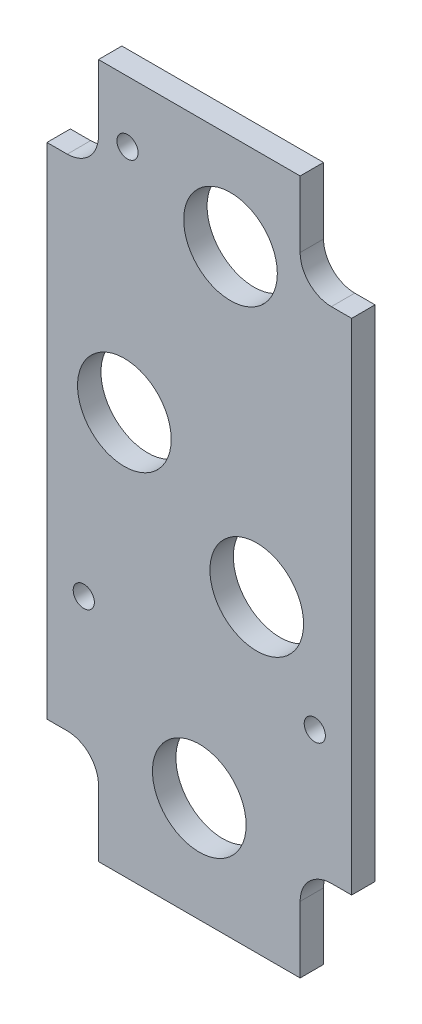
ISO-10303-21;
HEADER;
FILE_DESCRIPTION(('STEP AP214'),'2;1');
FILE_NAME('part.step','',(''),(''),'','','');
FILE_SCHEMA(('AUTOMOTIVE_DESIGN { 1 0 10303 214 1 1 1 1 }'));
ENDSEC;
DATA;
#1=APPLICATION_CONTEXT('core data for automotive mechanical design processes');
#2=APPLICATION_PROTOCOL_DEFINITION('international standard','automotive_design',2000,#1);
#3=PRODUCT_CONTEXT('',#1,'mechanical');
#4=PRODUCT('Part','Part','',(#3));
#5=PRODUCT_RELATED_PRODUCT_CATEGORY('part','',(#4));
#6=PRODUCT_DEFINITION_FORMATION('','',#4);
#7=PRODUCT_DEFINITION_CONTEXT('part definition',#1,'design');
#8=PRODUCT_DEFINITION('design','',#6,#7);
#9=PRODUCT_DEFINITION_SHAPE('','',#8);
#10=(LENGTH_UNIT() NAMED_UNIT(*) SI_UNIT(.MILLI.,.METRE.));
#11=(NAMED_UNIT(*) PLANE_ANGLE_UNIT() SI_UNIT($,.RADIAN.));
#12=(NAMED_UNIT(*) SI_UNIT($,.STERADIAN.) SOLID_ANGLE_UNIT());
#13=UNCERTAINTY_MEASURE_WITH_UNIT(LENGTH_MEASURE(1.E-05),#10,'distance_accuracy_value','');
#14=(GEOMETRIC_REPRESENTATION_CONTEXT(3) GLOBAL_UNCERTAINTY_ASSIGNED_CONTEXT((#13)) GLOBAL_UNIT_ASSIGNED_CONTEXT((#10,
#11,#12)) REPRESENTATION_CONTEXT('',''));
#15=CARTESIAN_POINT('',(0.,0.,0.));
#16=DIRECTION('',(0.,0.,1.));
#17=DIRECTION('',(1.,0.,0.));
#18=AXIS2_PLACEMENT_3D('',#15,#16,#17);
#19=CARTESIAN_POINT('',(-26.8605000000001,-128.5875,-1.0795));
#20=DIRECTION('',(0.,0.,-1.));
#21=DIRECTION('',(-1.,0.,0.));
#22=AXIS2_PLACEMENT_3D('',#19,#20,#21);
#23=CYLINDRICAL_SURFACE('',#22,6.34999999999999);
#24=CARTESIAN_POINT('',(-26.8605000000001,-128.5875,-5.842));
#25=DIRECTION('',(0.,0.,-1.));
#26=DIRECTION('',(1.,0.,0.));
#27=AXIS2_PLACEMENT_3D('',#24,#25,#26);
#28=CIRCLE('',#27,6.34999999999999);
#29=CARTESIAN_POINT('',(-26.8605000000001,-122.2375,-5.842));
#30=VERTEX_POINT('',#29);
#31=CARTESIAN_POINT('',(-20.5105000000001,-128.5875,-5.842));
#32=VERTEX_POINT('',#31);
#33=EDGE_CURVE('E176',#30,#32,#28,.T.);
#34=ORIENTED_EDGE('',*,*,#33,.T.);
#35=DIRECTION('',(0.,0.,-1.));
#36=VECTOR('',#35,1.);
#37=CARTESIAN_POINT('',(-20.5105000000001,-128.5875,-1.0795));
#38=LINE('',#37,#36);
#39=CARTESIAN_POINT('',(-20.5105000000001,-128.5875,-1.0795));
#40=VERTEX_POINT('',#39);
#41=EDGE_CURVE('E11',#40,#32,#38,.T.);
#42=ORIENTED_EDGE('',*,*,#41,.F.);
#43=CARTESIAN_POINT('',(-26.8605000000001,-128.5875,-1.0795));
#44=DIRECTION('',(0.,0.,-1.));
#45=DIRECTION('',(1.,0.,0.));
#46=AXIS2_PLACEMENT_3D('',#43,#44,#45);
#47=CIRCLE('',#46,6.34999999999999);
#48=CARTESIAN_POINT('',(-26.8605000000001,-122.2375,-1.0795));
#49=VERTEX_POINT('',#48);
#50=EDGE_CURVE('E207',#49,#40,#47,.T.);
#51=ORIENTED_EDGE('',*,*,#50,.F.);
#52=DIRECTION('',(0.,0.,-1.));
#53=VECTOR('',#52,1.);
#54=CARTESIAN_POINT('',(-26.8605000000001,-122.2375,-1.0795));
#55=LINE('',#54,#53);
#56=EDGE_CURVE('E172',#49,#30,#55,.T.);
#57=ORIENTED_EDGE('',*,*,#56,.T.);
#58=EDGE_LOOP('',(#34,#42,#51,#57));
#59=FACE_BOUND('',#58,.T.);
#60=ADVANCED_FACE('F32',(#59),#23,.F.);
#61=CARTESIAN_POINT('',(-20.5105000000001,-128.5875,-1.0795));
#62=DIRECTION('',(1.,0.,0.));
#63=DIRECTION('',(0.,0.,-1.));
#64=AXIS2_PLACEMENT_3D('',#61,#62,#63);
#65=PLANE('',#64);
#66=DIRECTION('',(0.,-1.,0.));
#67=VECTOR('',#66,1.);
#68=CARTESIAN_POINT('',(-20.5105000000001,-128.5875,-5.842));
#69=LINE('',#68,#67);
#70=CARTESIAN_POINT('',(-20.5105000000001,-142.08125,-5.842));
#71=VERTEX_POINT('',#70);
#72=EDGE_CURVE('E179',#32,#71,#69,.T.);
#73=ORIENTED_EDGE('',*,*,#72,.T.);
#74=DIRECTION('',(0.,0.,-1.));
#75=VECTOR('',#74,1.);
#76=CARTESIAN_POINT('',(-20.5105000000001,-142.08125,-1.0795));
#77=LINE('',#76,#75);
#78=CARTESIAN_POINT('',(-20.5105000000001,-142.08125,-1.0795));
#79=VERTEX_POINT('',#78);
#80=EDGE_CURVE('E40',#79,#71,#77,.T.);
#81=ORIENTED_EDGE('',*,*,#80,.F.);
#82=DIRECTION('',(0.,-1.,0.));
#83=VECTOR('',#82,1.);
#84=CARTESIAN_POINT('',(-20.5105000000001,-128.5875,-1.0795));
#85=LINE('',#84,#83);
#86=EDGE_CURVE('E115',#40,#79,#85,.T.);
#87=ORIENTED_EDGE('',*,*,#86,.F.);
#88=ORIENTED_EDGE('',*,*,#41,.T.);
#89=EDGE_LOOP('',(#73,#81,#87,#88));
#90=FACE_BOUND('',#89,.T.);
#91=ADVANCED_FACE('F306',(#90),#65,.F.);
#92=CARTESIAN_POINT('',(-20.5105000000001,-142.08125,-1.0795));
#93=DIRECTION('',(0.,1.,0.));
#94=DIRECTION('',(0.,0.,1.));
#95=AXIS2_PLACEMENT_3D('',#92,#93,#94);
#96=PLANE('',#95);
#97=DIRECTION('',(1.,0.,0.));
#98=VECTOR('',#97,1.);
#99=CARTESIAN_POINT('',(-20.5105000000001,-142.08125,-5.842));
#100=LINE('',#99,#98);
#101=CARTESIAN_POINT('',(20.5105,-142.08125,-5.842));
#102=VERTEX_POINT('',#101);
#103=EDGE_CURVE('E182',#71,#102,#100,.T.);
#104=ORIENTED_EDGE('',*,*,#103,.T.);
#105=DIRECTION('',(0.,0.,-1.));
#106=VECTOR('',#105,1.);
#107=CARTESIAN_POINT('',(20.5105,-142.08125,-1.0795));
#108=LINE('',#107,#106);
#109=CARTESIAN_POINT('',(20.5105,-142.08125,-1.0795));
#110=VERTEX_POINT('',#109);
#111=EDGE_CURVE('E238',#110,#102,#108,.T.);
#112=ORIENTED_EDGE('',*,*,#111,.F.);
#113=DIRECTION('',(1.,0.,0.));
#114=VECTOR('',#113,1.);
#115=CARTESIAN_POINT('',(-20.5105000000001,-142.08125,-1.0795));
#116=LINE('',#115,#114);
#117=EDGE_CURVE('E246',#79,#110,#116,.T.);
#118=ORIENTED_EDGE('',*,*,#117,.F.);
#119=ORIENTED_EDGE('',*,*,#80,.T.);
#120=EDGE_LOOP('',(#104,#112,#118,#119));
#121=FACE_BOUND('',#120,.T.);
#122=ADVANCED_FACE('F244',(#121),#96,.F.);
#123=CARTESIAN_POINT('',(20.5105,-142.08125,-1.0795));
#124=DIRECTION('',(-1.,0.,0.));
#125=DIRECTION('',(0.,-1.,0.));
#126=AXIS2_PLACEMENT_3D('',#123,#124,#125);
#127=PLANE('',#126);
#128=DIRECTION('',(0.,1.,0.));
#129=VECTOR('',#128,1.);
#130=CARTESIAN_POINT('',(20.5105,-142.08125,-5.842));
#131=LINE('',#130,#129);
#132=CARTESIAN_POINT('',(20.5105,-128.5875,-5.842));
#133=VERTEX_POINT('',#132);
#134=EDGE_CURVE('E184',#102,#133,#131,.T.);
#135=ORIENTED_EDGE('',*,*,#134,.T.);
#136=DIRECTION('',(0.,0.,-1.));
#137=VECTOR('',#136,1.);
#138=CARTESIAN_POINT('',(20.5105,-128.5875,-1.0795));
#139=LINE('',#138,#137);
#140=CARTESIAN_POINT('',(20.5105,-128.5875,-1.0795));
#141=VERTEX_POINT('',#140);
#142=EDGE_CURVE('E235',#141,#133,#139,.T.);
#143=ORIENTED_EDGE('',*,*,#142,.F.);
#144=DIRECTION('',(0.,1.,0.));
#145=VECTOR('',#144,1.);
#146=CARTESIAN_POINT('',(20.5105,-142.08125,-1.0795));
#147=LINE('',#146,#145);
#148=EDGE_CURVE('E264',#110,#141,#147,.T.);
#149=ORIENTED_EDGE('',*,*,#148,.F.);
#150=ORIENTED_EDGE('',*,*,#111,.T.);
#151=EDGE_LOOP('',(#135,#143,#149,#150));
#152=FACE_BOUND('',#151,.T.);
#153=ADVANCED_FACE('F255',(#152),#127,.F.);
#154=CARTESIAN_POINT('',(26.8605,-128.5875,-1.0795));
#155=DIRECTION('',(0.,0.,-1.));
#156=DIRECTION('',(-1.,0.,0.));
#157=AXIS2_PLACEMENT_3D('',#154,#155,#156);
#158=CYLINDRICAL_SURFACE('',#157,6.34999999999998);
#159=CARTESIAN_POINT('',(26.8605,-128.5875,-5.842));
#160=DIRECTION('',(0.,0.,-1.));
#161=DIRECTION('',(1.,0.,0.));
#162=AXIS2_PLACEMENT_3D('',#159,#160,#161);
#163=CIRCLE('',#162,6.34999999999998);
#164=CARTESIAN_POINT('',(26.8605,-122.2375,-5.842));
#165=VERTEX_POINT('',#164);
#166=EDGE_CURVE('E186',#133,#165,#163,.T.);
#167=ORIENTED_EDGE('',*,*,#166,.T.);
#168=DIRECTION('',(0.,0.,-1.));
#169=VECTOR('',#168,1.);
#170=CARTESIAN_POINT('',(26.8605,-122.2375,-1.0795));
#171=LINE('',#170,#169);
#172=CARTESIAN_POINT('',(26.8605,-122.2375,-1.0795));
#173=VERTEX_POINT('',#172);
#174=EDGE_CURVE('E232',#173,#165,#171,.T.);
#175=ORIENTED_EDGE('',*,*,#174,.F.);
#176=CARTESIAN_POINT('',(26.8605,-128.5875,-1.0795));
#177=DIRECTION('',(0.,0.,-1.));
#178=DIRECTION('',(1.,0.,0.));
#179=AXIS2_PLACEMENT_3D('',#176,#177,#178);
#180=CIRCLE('',#179,6.34999999999998);
#181=EDGE_CURVE('E261',#141,#173,#180,.T.);
#182=ORIENTED_EDGE('',*,*,#181,.F.);
#183=ORIENTED_EDGE('',*,*,#142,.T.);
#184=EDGE_LOOP('',(#167,#175,#182,#183));
#185=FACE_BOUND('',#184,.T.);
#186=ADVANCED_FACE('F259',(#185),#158,.F.);
#187=CARTESIAN_POINT('',(26.8605,-122.2375,-1.0795));
#188=DIRECTION('',(0.,1.,0.));
#189=DIRECTION('',(0.,0.,1.));
#190=AXIS2_PLACEMENT_3D('',#187,#188,#189);
#191=PLANE('',#190);
#192=DIRECTION('',(1.,0.,0.));
#193=VECTOR('',#192,1.);
#194=CARTESIAN_POINT('',(26.8605,-122.2375,-5.842));
#195=LINE('',#194,#193);
#196=CARTESIAN_POINT('',(30.988,-122.2375,-5.842));
#197=VERTEX_POINT('',#196);
#198=EDGE_CURVE('E188',#165,#197,#195,.T.);
#199=ORIENTED_EDGE('',*,*,#198,.T.);
#200=DIRECTION('',(0.,0.,-1.));
#201=VECTOR('',#200,1.);
#202=CARTESIAN_POINT('',(30.988,-122.2375,-1.0795));
#203=LINE('',#202,#201);
#204=CARTESIAN_POINT('',(30.988,-122.2375,-1.0795));
#205=VERTEX_POINT('',#204);
#206=EDGE_CURVE('E229',#205,#197,#203,.T.);
#207=ORIENTED_EDGE('',*,*,#206,.F.);
#208=DIRECTION('',(1.,0.,0.));
#209=VECTOR('',#208,1.);
#210=CARTESIAN_POINT('',(26.8605,-122.2375,-1.0795));
#211=LINE('',#210,#209);
#212=EDGE_CURVE('E263',#173,#205,#211,.T.);
#213=ORIENTED_EDGE('',*,*,#212,.F.);
#214=ORIENTED_EDGE('',*,*,#174,.T.);
#215=EDGE_LOOP('',(#199,#207,#213,#214));
#216=FACE_BOUND('',#215,.T.);
#217=ADVANCED_FACE('F319',(#216),#191,.F.);
#218=CARTESIAN_POINT('',(30.988,-122.2375,-1.0795));
#219=DIRECTION('',(-1.,0.,0.));
#220=DIRECTION('',(0.,0.,1.));
#221=AXIS2_PLACEMENT_3D('',#218,#219,#220);
#222=PLANE('',#221);
#223=DIRECTION('',(0.,1.,0.));
#224=VECTOR('',#223,1.);
#225=CARTESIAN_POINT('',(30.988,-122.2375,-5.842));
#226=LINE('',#225,#224);
#227=CARTESIAN_POINT('',(30.988,-20.6375,-5.842));
#228=VERTEX_POINT('',#227);
#229=EDGE_CURVE('E190',#197,#228,#226,.T.);
#230=ORIENTED_EDGE('',*,*,#229,.T.);
#231=DIRECTION('',(0.,0.,-1.));
#232=VECTOR('',#231,1.);
#233=CARTESIAN_POINT('',(30.988,-20.6375,-1.0795));
#234=LINE('',#233,#232);
#235=CARTESIAN_POINT('',(30.988,-20.6375,-1.0795));
#236=VERTEX_POINT('',#235);
#237=EDGE_CURVE('E226',#236,#228,#234,.T.);
#238=ORIENTED_EDGE('',*,*,#237,.F.);
#239=DIRECTION('',(0.,1.,0.));
#240=VECTOR('',#239,1.);
#241=CARTESIAN_POINT('',(30.988,-122.2375,-1.0795));
#242=LINE('',#241,#240);
#243=EDGE_CURVE('E266',#205,#236,#242,.T.);
#244=ORIENTED_EDGE('',*,*,#243,.F.);
#245=ORIENTED_EDGE('',*,*,#206,.T.);
#246=EDGE_LOOP('',(#230,#238,#244,#245));
#247=FACE_BOUND('',#246,.T.);
#248=ADVANCED_FACE('F322',(#247),#222,.F.);
#249=CARTESIAN_POINT('',(30.988,-20.6375,-1.0795));
#250=DIRECTION('',(0.,-1.,0.));
#251=DIRECTION('',(0.,0.,-1.));
#252=AXIS2_PLACEMENT_3D('',#249,#250,#251);
#253=PLANE('',#252);
#254=DIRECTION('',(-1.,0.,0.));
#255=VECTOR('',#254,1.);
#256=CARTESIAN_POINT('',(30.988,-20.6375,-5.842));
#257=LINE('',#256,#255);
#258=CARTESIAN_POINT('',(26.8605,-20.6375,-5.842));
#259=VERTEX_POINT('',#258);
#260=EDGE_CURVE('E192',#228,#259,#257,.T.);
#261=ORIENTED_EDGE('',*,*,#260,.T.);
#262=DIRECTION('',(0.,0.,-1.));
#263=VECTOR('',#262,1.);
#264=CARTESIAN_POINT('',(26.8605,-20.6375,-1.0795));
#265=LINE('',#264,#263);
#266=CARTESIAN_POINT('',(26.8605,-20.6375,-1.0795));
#267=VERTEX_POINT('',#266);
#268=EDGE_CURVE('E223',#267,#259,#265,.T.);
#269=ORIENTED_EDGE('',*,*,#268,.F.);
#270=DIRECTION('',(-1.,0.,0.));
#271=VECTOR('',#270,1.);
#272=CARTESIAN_POINT('',(30.988,-20.6375,-1.0795));
#273=LINE('',#272,#271);
#274=EDGE_CURVE('E272',#236,#267,#273,.T.);
#275=ORIENTED_EDGE('',*,*,#274,.F.);
#276=ORIENTED_EDGE('',*,*,#237,.T.);
#277=EDGE_LOOP('',(#261,#269,#275,#276));
#278=FACE_BOUND('',#277,.T.);
#279=ADVANCED_FACE('F326',(#278),#253,.F.);
#280=CARTESIAN_POINT('',(26.8605,-14.2875,-1.0795));
#281=DIRECTION('',(0.,0.,-1.));
#282=DIRECTION('',(-1.,0.,0.));
#283=AXIS2_PLACEMENT_3D('',#280,#281,#282);
#284=CYLINDRICAL_SURFACE('',#283,6.35);
#285=CARTESIAN_POINT('',(26.8605,-14.2875,-5.842));
#286=DIRECTION('',(0.,0.,-1.));
#287=DIRECTION('',(1.,0.,0.));
#288=AXIS2_PLACEMENT_3D('',#285,#286,#287);
#289=CIRCLE('',#288,6.35);
#290=CARTESIAN_POINT('',(20.5105,-14.2875,-5.842));
#291=VERTEX_POINT('',#290);
#292=EDGE_CURVE('E194',#259,#291,#289,.T.);
#293=ORIENTED_EDGE('',*,*,#292,.T.);
#294=DIRECTION('',(0.,0.,-1.));
#295=VECTOR('',#294,1.);
#296=CARTESIAN_POINT('',(20.5105,-14.2875,-1.0795));
#297=LINE('',#296,#295);
#298=CARTESIAN_POINT('',(20.5105,-14.2875,-1.0795));
#299=VERTEX_POINT('',#298);
#300=EDGE_CURVE('E220',#299,#291,#297,.T.);
#301=ORIENTED_EDGE('',*,*,#300,.F.);
#302=CARTESIAN_POINT('',(26.8605,-14.2875,-1.0795));
#303=DIRECTION('',(0.,0.,-1.));
#304=DIRECTION('',(1.,0.,0.));
#305=AXIS2_PLACEMENT_3D('',#302,#303,#304);
#306=CIRCLE('',#305,6.35);
#307=EDGE_CURVE('E274',#267,#299,#306,.T.);
#308=ORIENTED_EDGE('',*,*,#307,.F.);
#309=ORIENTED_EDGE('',*,*,#268,.T.);
#310=EDGE_LOOP('',(#293,#301,#308,#309));
#311=FACE_BOUND('',#310,.T.);
#312=ADVANCED_FACE('F330',(#311),#284,.F.);
#313=CARTESIAN_POINT('',(20.5105,-14.2875,-1.0795));
#314=DIRECTION('',(-1.,0.,0.));
#315=DIRECTION('',(0.,-1.,0.));
#316=AXIS2_PLACEMENT_3D('',#313,#314,#315);
#317=PLANE('',#316);
#318=DIRECTION('',(0.,1.,0.));
#319=VECTOR('',#318,1.);
#320=CARTESIAN_POINT('',(20.5105,-14.2875,-5.842));
#321=LINE('',#320,#319);
#322=CARTESIAN_POINT('',(20.5105,-0.79375000000001,-5.842));
#323=VERTEX_POINT('',#322);
#324=EDGE_CURVE('E196',#291,#323,#321,.T.);
#325=ORIENTED_EDGE('',*,*,#324,.T.);
#326=DIRECTION('',(0.,0.,-1.));
#327=VECTOR('',#326,1.);
#328=CARTESIAN_POINT('',(20.5105,-0.79375000000001,-1.0795));
#329=LINE('',#328,#327);
#330=CARTESIAN_POINT('',(20.5105,-0.79375000000001,-1.0795));
#331=VERTEX_POINT('',#330);
#332=EDGE_CURVE('E217',#331,#323,#329,.T.);
#333=ORIENTED_EDGE('',*,*,#332,.F.);
#334=DIRECTION('',(0.,1.,0.));
#335=VECTOR('',#334,1.);
#336=CARTESIAN_POINT('',(20.5105,-14.2875,-1.0795));
#337=LINE('',#336,#335);
#338=EDGE_CURVE('E276',#299,#331,#337,.T.);
#339=ORIENTED_EDGE('',*,*,#338,.F.);
#340=ORIENTED_EDGE('',*,*,#300,.T.);
#341=EDGE_LOOP('',(#325,#333,#339,#340));
#342=FACE_BOUND('',#341,.T.);
#343=ADVANCED_FACE('F334',(#342),#317,.F.);
#344=CARTESIAN_POINT('',(20.5105,-0.79375000000001,-1.0795));
#345=DIRECTION('',(0.,-1.,0.));
#346=DIRECTION('',(0.,0.,-1.));
#347=AXIS2_PLACEMENT_3D('',#344,#345,#346);
#348=PLANE('',#347);
#349=DIRECTION('',(-1.,0.,0.));
#350=VECTOR('',#349,1.);
#351=CARTESIAN_POINT('',(20.5105,-0.79375000000001,-5.842));
#352=LINE('',#351,#350);
#353=CARTESIAN_POINT('',(-20.5105000000001,-0.79375000000001,-5.842));
#354=VERTEX_POINT('',#353);
#355=EDGE_CURVE('E198',#323,#354,#352,.T.);
#356=ORIENTED_EDGE('',*,*,#355,.T.);
#357=DIRECTION('',(0.,0.,-1.));
#358=VECTOR('',#357,1.);
#359=CARTESIAN_POINT('',(-20.5105000000001,-0.79375000000001,-1.0795));
#360=LINE('',#359,#358);
#361=CARTESIAN_POINT('',(-20.5105000000001,-0.79375000000001,-1.0795));
#362=VERTEX_POINT('',#361);
#363=EDGE_CURVE('E214',#362,#354,#360,.T.);
#364=ORIENTED_EDGE('',*,*,#363,.F.);
#365=DIRECTION('',(-1.,0.,0.));
#366=VECTOR('',#365,1.);
#367=CARTESIAN_POINT('',(20.5105,-0.79375000000001,-1.0795));
#368=LINE('',#367,#366);
#369=EDGE_CURVE('E278',#331,#362,#368,.T.);
#370=ORIENTED_EDGE('',*,*,#369,.F.);
#371=ORIENTED_EDGE('',*,*,#332,.T.);
#372=EDGE_LOOP('',(#356,#364,#370,#371));
#373=FACE_BOUND('',#372,.T.);
#374=ADVANCED_FACE('F338',(#373),#348,.F.);
#375=CARTESIAN_POINT('',(-20.5105000000001,-0.79375000000001,-1.0795));
#376=DIRECTION('',(1.,0.,0.));
#377=DIRECTION('',(0.,0.,-1.));
#378=AXIS2_PLACEMENT_3D('',#375,#376,#377);
#379=PLANE('',#378);
#380=DIRECTION('',(0.,-1.,0.));
#381=VECTOR('',#380,1.);
#382=CARTESIAN_POINT('',(-20.5105000000001,-0.79375000000001,-5.842));
#383=LINE('',#382,#381);
#384=CARTESIAN_POINT('',(-20.5105000000001,-14.2875,-5.842));
#385=VERTEX_POINT('',#384);
#386=EDGE_CURVE('E200',#354,#385,#383,.T.);
#387=ORIENTED_EDGE('',*,*,#386,.T.);
#388=DIRECTION('',(0.,0.,-1.));
#389=VECTOR('',#388,1.);
#390=CARTESIAN_POINT('',(-20.5105000000001,-14.2875,-1.0795));
#391=LINE('',#390,#389);
#392=CARTESIAN_POINT('',(-20.5105000000001,-14.2875,-1.0795));
#393=VERTEX_POINT('',#392);
#394=EDGE_CURVE('E211',#393,#385,#391,.T.);
#395=ORIENTED_EDGE('',*,*,#394,.F.);
#396=DIRECTION('',(0.,-1.,0.));
#397=VECTOR('',#396,1.);
#398=CARTESIAN_POINT('',(-20.5105000000001,-0.79375000000001,-1.0795));
#399=LINE('',#398,#397);
#400=EDGE_CURVE('E280',#362,#393,#399,.T.);
#401=ORIENTED_EDGE('',*,*,#400,.F.);
#402=ORIENTED_EDGE('',*,*,#363,.T.);
#403=EDGE_LOOP('',(#387,#395,#401,#402));
#404=FACE_BOUND('',#403,.T.);
#405=ADVANCED_FACE('F286',(#404),#379,.F.);
#406=CARTESIAN_POINT('',(-26.8605000000001,-14.2875,-1.0795));
#407=DIRECTION('',(0.,0.,-1.));
#408=DIRECTION('',(-1.,0.,0.));
#409=AXIS2_PLACEMENT_3D('',#406,#407,#408);
#410=CYLINDRICAL_SURFACE('',#409,6.35);
#411=CARTESIAN_POINT('',(-26.8605000000001,-14.2875,-5.842));
#412=DIRECTION('',(0.,0.,-1.));
#413=DIRECTION('',(1.,0.,0.));
#414=AXIS2_PLACEMENT_3D('',#411,#412,#413);
#415=CIRCLE('',#414,6.35);
#416=CARTESIAN_POINT('',(-26.8605000000001,-20.6375,-5.842));
#417=VERTEX_POINT('',#416);
#418=EDGE_CURVE('E202',#385,#417,#415,.T.);
#419=ORIENTED_EDGE('',*,*,#418,.T.);
#420=DIRECTION('',(0.,0.,-1.));
#421=VECTOR('',#420,1.);
#422=CARTESIAN_POINT('',(-26.8605000000001,-20.6375,-1.0795));
#423=LINE('',#422,#421);
#424=CARTESIAN_POINT('',(-26.8605000000001,-20.6375,-1.0795));
#425=VERTEX_POINT('',#424);
#426=EDGE_CURVE('E167',#425,#417,#423,.T.);
#427=ORIENTED_EDGE('',*,*,#426,.F.);
#428=CARTESIAN_POINT('',(-26.8605000000001,-14.2875,-1.0795));
#429=DIRECTION('',(0.,0.,-1.));
#430=DIRECTION('',(1.,0.,0.));
#431=AXIS2_PLACEMENT_3D('',#428,#429,#430);
#432=CIRCLE('',#431,6.35);
#433=EDGE_CURVE('E158',#393,#425,#432,.T.);
#434=ORIENTED_EDGE('',*,*,#433,.F.);
#435=ORIENTED_EDGE('',*,*,#394,.T.);
#436=EDGE_LOOP('',(#419,#427,#434,#435));
#437=FACE_BOUND('',#436,.T.);
#438=ADVANCED_FACE('F290',(#437),#410,.F.);
#439=CARTESIAN_POINT('',(-26.8605000000001,-20.6375,-1.0795));
#440=DIRECTION('',(0.,-1.,0.));
#441=DIRECTION('',(0.,0.,-1.));
#442=AXIS2_PLACEMENT_3D('',#439,#440,#441);
#443=PLANE('',#442);
#444=DIRECTION('',(-1.,0.,0.));
#445=VECTOR('',#444,1.);
#446=CARTESIAN_POINT('',(-26.8605000000001,-20.6375,-5.842));
#447=LINE('',#446,#445);
#448=CARTESIAN_POINT('',(-30.9880000000001,-20.6375,-5.842));
#449=VERTEX_POINT('',#448);
#450=EDGE_CURVE('E166',#417,#449,#447,.T.);
#451=ORIENTED_EDGE('',*,*,#450,.T.);
#452=DIRECTION('',(0.,0.,-1.));
#453=VECTOR('',#452,1.);
#454=CARTESIAN_POINT('',(-30.9880000000001,-20.6375,-1.0795));
#455=LINE('',#454,#453);
#456=CARTESIAN_POINT('',(-30.9880000000001,-20.6375,-1.0795));
#457=VERTEX_POINT('',#456);
#458=EDGE_CURVE('E163',#457,#449,#455,.T.);
#459=ORIENTED_EDGE('',*,*,#458,.F.);
#460=DIRECTION('',(-1.,0.,0.));
#461=VECTOR('',#460,1.);
#462=CARTESIAN_POINT('',(-26.8605000000001,-20.6375,-1.0795));
#463=LINE('',#462,#461);
#464=EDGE_CURVE('E152',#425,#457,#463,.T.);
#465=ORIENTED_EDGE('',*,*,#464,.F.);
#466=ORIENTED_EDGE('',*,*,#426,.T.);
#467=EDGE_LOOP('',(#451,#459,#465,#466));
#468=FACE_BOUND('',#467,.T.);
#469=ADVANCED_FACE('F164',(#468),#443,.F.);
#470=CARTESIAN_POINT('',(-30.9880000000001,-20.6375,-1.0795));
#471=DIRECTION('',(1.,0.,0.));
#472=DIRECTION('',(0.,1.,0.));
#473=AXIS2_PLACEMENT_3D('',#470,#471,#472);
#474=PLANE('',#473);
#475=DIRECTION('',(0.,-1.,0.));
#476=VECTOR('',#475,1.);
#477=CARTESIAN_POINT('',(-30.9880000000001,-20.6375,-5.842));
#478=LINE('',#477,#476);
#479=CARTESIAN_POINT('',(-30.988,-122.2375,-5.842));
#480=VERTEX_POINT('',#479);
#481=EDGE_CURVE('E101',#449,#480,#478,.T.);
#482=ORIENTED_EDGE('',*,*,#481,.T.);
#483=DIRECTION('',(0.,0.,-1.));
#484=VECTOR('',#483,1.);
#485=CARTESIAN_POINT('',(-30.988,-122.2375,-1.0795));
#486=LINE('',#485,#484);
#487=CARTESIAN_POINT('',(-30.988,-122.2375,-1.0795));
#488=VERTEX_POINT('',#487);
#489=EDGE_CURVE('E168',#488,#480,#486,.T.);
#490=ORIENTED_EDGE('',*,*,#489,.F.);
#491=DIRECTION('',(0.,-1.,0.));
#492=VECTOR('',#491,1.);
#493=CARTESIAN_POINT('',(-30.9880000000001,-20.6375,-1.0795));
#494=LINE('',#493,#492);
#495=EDGE_CURVE('E156',#457,#488,#494,.T.);
#496=ORIENTED_EDGE('',*,*,#495,.F.);
#497=ORIENTED_EDGE('',*,*,#458,.T.);
#498=EDGE_LOOP('',(#482,#490,#496,#497));
#499=FACE_BOUND('',#498,.T.);
#500=ADVANCED_FACE('F170',(#499),#474,.F.);
#501=CARTESIAN_POINT('',(-30.988,-122.2375,-1.0795));
#502=DIRECTION('',(0.,1.,0.));
#503=DIRECTION('',(-1.,0.,0.));
#504=AXIS2_PLACEMENT_3D('',#501,#502,#503);
#505=PLANE('',#504);
#506=DIRECTION('',(1.,0.,0.));
#507=VECTOR('',#506,1.);
#508=CARTESIAN_POINT('',(-30.988,-122.2375,-5.842));
#509=LINE('',#508,#507);
#510=EDGE_CURVE('E107',#480,#30,#509,.T.);
#511=ORIENTED_EDGE('',*,*,#510,.T.);
#512=ORIENTED_EDGE('',*,*,#56,.F.);
#513=DIRECTION('',(1.,0.,0.));
#514=VECTOR('',#513,1.);
#515=CARTESIAN_POINT('',(-30.988,-122.2375,-1.0795));
#516=LINE('',#515,#514);
#517=EDGE_CURVE('E48',#488,#49,#516,.T.);
#518=ORIENTED_EDGE('',*,*,#517,.F.);
#519=ORIENTED_EDGE('',*,*,#489,.T.);
#520=EDGE_LOOP('',(#511,#512,#518,#519));
#521=FACE_BOUND('',#520,.T.);
#522=ADVANCED_FACE('F294',(#521),#505,.F.);
#523=CARTESIAN_POINT('',(-26.8605000000001,-128.5875,-1.0795));
#524=DIRECTION('',(0.,0.,1.));
#525=DIRECTION('',(1.,0.,0.));
#526=AXIS2_PLACEMENT_3D('',#523,#524,#525);
#527=PLANE('',#526);
#528=CARTESIAN_POINT('',(-15.2400000000001,-60.325,-1.0795));
#529=DIRECTION('',(0.,0.,1.));
#530=DIRECTION('',(1.,0.,0.));
#531=AXIS2_PLACEMENT_3D('',#528,#529,#530);
#532=CIRCLE('',#531,9.525);
#533=CARTESIAN_POINT('',(-5.71500000000005,-60.325,-1.0795));
#534=VERTEX_POINT('',#533);
#535=EDGE_CURVE('E454',#534,#534,#532,.T.);
#536=ORIENTED_EDGE('',*,*,#535,.F.);
#537=EDGE_LOOP('',(#536));
#538=FACE_BOUND('',#537,.T.);
#539=CARTESIAN_POINT('',(6.34999999999997,-20.32,-1.0795));
#540=DIRECTION('',(0.,0.,1.));
#541=DIRECTION('',(1.,0.,0.));
#542=AXIS2_PLACEMENT_3D('',#539,#540,#541);
#543=CIRCLE('',#542,9.525);
#544=CARTESIAN_POINT('',(15.875,-20.32,-1.0795));
#545=VERTEX_POINT('',#544);
#546=EDGE_CURVE('E456',#545,#545,#543,.T.);
#547=ORIENTED_EDGE('',*,*,#546,.F.);
#548=EDGE_LOOP('',(#547));
#549=FACE_BOUND('',#548,.T.);
#550=CARTESIAN_POINT('',(11.684,-79.375,-1.0795));
#551=DIRECTION('',(0.,0.,1.));
#552=DIRECTION('',(1.,0.,0.));
#553=AXIS2_PLACEMENT_3D('',#550,#551,#552);
#554=CIRCLE('',#553,9.525);
#555=CARTESIAN_POINT('',(21.209,-79.375,-1.0795));
#556=VERTEX_POINT('',#555);
#557=EDGE_CURVE('E464',#556,#556,#554,.T.);
#558=ORIENTED_EDGE('',*,*,#557,.F.);
#559=EDGE_LOOP('',(#558));
#560=FACE_BOUND('',#559,.T.);
#561=CARTESIAN_POINT('',(0.,-120.65,-1.0795));
#562=DIRECTION('',(0.,0.,1.));
#563=DIRECTION('',(1.,0.,0.));
#564=AXIS2_PLACEMENT_3D('',#561,#562,#563);
#565=CIRCLE('',#564,9.525);
#566=CARTESIAN_POINT('',(9.52499999999997,-120.65,-1.0795));
#567=VERTEX_POINT('',#566);
#568=EDGE_CURVE('E470',#567,#567,#565,.T.);
#569=ORIENTED_EDGE('',*,*,#568,.F.);
#570=EDGE_LOOP('',(#569));
#571=FACE_BOUND('',#570,.T.);
#572=CARTESIAN_POINT('',(-14.605,-13.208,-1.0795));
#573=DIRECTION('',(0.,0.,1.));
#574=DIRECTION('',(1.,0.,0.));
#575=AXIS2_PLACEMENT_3D('',#572,#573,#574);
#576=CIRCLE('',#575,2.15265);
#577=CARTESIAN_POINT('',(-12.45235,-13.208,-1.0795));
#578=VERTEX_POINT('',#577);
#579=EDGE_CURVE('E476',#578,#578,#576,.T.);
#580=ORIENTED_EDGE('',*,*,#579,.F.);
#581=EDGE_LOOP('',(#580));
#582=FACE_BOUND('',#581,.T.);
#583=CARTESIAN_POINT('',(-23.495,-96.8375,-1.0795));
#584=DIRECTION('',(0.,0.,1.));
#585=DIRECTION('',(1.,0.,0.));
#586=AXIS2_PLACEMENT_3D('',#583,#584,#585);
#587=CIRCLE('',#586,2.15265);
#588=CARTESIAN_POINT('',(-21.34235,-96.8375,-1.0795));
#589=VERTEX_POINT('',#588);
#590=EDGE_CURVE('E482',#589,#589,#587,.T.);
#591=ORIENTED_EDGE('',*,*,#590,.F.);
#592=EDGE_LOOP('',(#591));
#593=FACE_BOUND('',#592,.T.);
#594=CARTESIAN_POINT('',(23.495,-96.8375,-1.0795));
#595=DIRECTION('',(0.,0.,1.));
#596=DIRECTION('',(1.,0.,0.));
#597=AXIS2_PLACEMENT_3D('',#594,#595,#596);
#598=CIRCLE('',#597,2.15265);
#599=CARTESIAN_POINT('',(25.64765,-96.8375,-1.0795));
#600=VERTEX_POINT('',#599);
#601=EDGE_CURVE('E488',#600,#600,#598,.T.);
#602=ORIENTED_EDGE('',*,*,#601,.F.);
#603=EDGE_LOOP('',(#602));
#604=FACE_BOUND('',#603,.T.);
#605=ORIENTED_EDGE('',*,*,#50,.T.);
#606=ORIENTED_EDGE('',*,*,#86,.T.);
#607=ORIENTED_EDGE('',*,*,#117,.T.);
#608=ORIENTED_EDGE('',*,*,#148,.T.);
#609=ORIENTED_EDGE('',*,*,#181,.T.);
#610=ORIENTED_EDGE('',*,*,#212,.T.);
#611=ORIENTED_EDGE('',*,*,#243,.T.);
#612=ORIENTED_EDGE('',*,*,#274,.T.);
#613=ORIENTED_EDGE('',*,*,#307,.T.);
#614=ORIENTED_EDGE('',*,*,#338,.T.);
#615=ORIENTED_EDGE('',*,*,#369,.T.);
#616=ORIENTED_EDGE('',*,*,#400,.T.);
#617=ORIENTED_EDGE('',*,*,#433,.T.);
#618=ORIENTED_EDGE('',*,*,#464,.T.);
#619=ORIENTED_EDGE('',*,*,#495,.T.);
#620=ORIENTED_EDGE('',*,*,#517,.T.);
#621=EDGE_LOOP('',(#605,#606,#607,#608,#609,#610,#611,#612,#613,#614,#615,#616,#617,#618,#619,#620));
#622=FACE_BOUND('',#621,.T.);
#623=ADVANCED_FACE('F154',(#538,#549,#560,#571,#582,#593,#604,#622),#527,.T.);
#624=CARTESIAN_POINT('',(-26.8605000000001,-128.5875,-5.842));
#625=DIRECTION('',(0.,0.,1.));
#626=DIRECTION('',(1.,0.,0.));
#627=AXIS2_PLACEMENT_3D('',#624,#625,#626);
#628=PLANE('',#627);
#629=CARTESIAN_POINT('',(-15.2400000000001,-60.325,-5.842));
#630=DIRECTION('',(0.,0.,1.));
#631=DIRECTION('',(1.,0.,0.));
#632=AXIS2_PLACEMENT_3D('',#629,#630,#631);
#633=CIRCLE('',#632,9.525);
#634=CARTESIAN_POINT('',(-5.71500000000005,-60.325,-5.842));
#635=VERTEX_POINT('',#634);
#636=EDGE_CURVE('E451',#635,#635,#633,.T.);
#637=ORIENTED_EDGE('',*,*,#636,.T.);
#638=EDGE_LOOP('',(#637));
#639=FACE_BOUND('',#638,.T.);
#640=CARTESIAN_POINT('',(6.34999999999997,-20.32,-5.842));
#641=DIRECTION('',(0.,0.,1.));
#642=DIRECTION('',(1.,0.,0.));
#643=AXIS2_PLACEMENT_3D('',#640,#641,#642);
#644=CIRCLE('',#643,9.525);
#645=CARTESIAN_POINT('',(15.875,-20.32,-5.842));
#646=VERTEX_POINT('',#645);
#647=EDGE_CURVE('E461',#646,#646,#644,.T.);
#648=ORIENTED_EDGE('',*,*,#647,.T.);
#649=EDGE_LOOP('',(#648));
#650=FACE_BOUND('',#649,.T.);
#651=CARTESIAN_POINT('',(11.684,-79.375,-5.842));
#652=DIRECTION('',(0.,0.,1.));
#653=DIRECTION('',(1.,0.,0.));
#654=AXIS2_PLACEMENT_3D('',#651,#652,#653);
#655=CIRCLE('',#654,9.525);
#656=CARTESIAN_POINT('',(21.209,-79.375,-5.842));
#657=VERTEX_POINT('',#656);
#658=EDGE_CURVE('E467',#657,#657,#655,.T.);
#659=ORIENTED_EDGE('',*,*,#658,.T.);
#660=EDGE_LOOP('',(#659));
#661=FACE_BOUND('',#660,.T.);
#662=CARTESIAN_POINT('',(0.,-120.65,-5.842));
#663=DIRECTION('',(0.,0.,1.));
#664=DIRECTION('',(1.,0.,0.));
#665=AXIS2_PLACEMENT_3D('',#662,#663,#664);
#666=CIRCLE('',#665,9.525);
#667=CARTESIAN_POINT('',(9.52499999999997,-120.65,-5.842));
#668=VERTEX_POINT('',#667);
#669=EDGE_CURVE('E473',#668,#668,#666,.T.);
#670=ORIENTED_EDGE('',*,*,#669,.T.);
#671=EDGE_LOOP('',(#670));
#672=FACE_BOUND('',#671,.T.);
#673=CARTESIAN_POINT('',(-14.605,-13.208,-5.842));
#674=DIRECTION('',(0.,0.,1.));
#675=DIRECTION('',(1.,0.,0.));
#676=AXIS2_PLACEMENT_3D('',#673,#674,#675);
#677=CIRCLE('',#676,2.15265);
#678=CARTESIAN_POINT('',(-12.45235,-13.208,-5.842));
#679=VERTEX_POINT('',#678);
#680=EDGE_CURVE('E479',#679,#679,#677,.T.);
#681=ORIENTED_EDGE('',*,*,#680,.T.);
#682=EDGE_LOOP('',(#681));
#683=FACE_BOUND('',#682,.T.);
#684=CARTESIAN_POINT('',(-23.495,-96.8375,-5.842));
#685=DIRECTION('',(0.,0.,1.));
#686=DIRECTION('',(1.,0.,0.));
#687=AXIS2_PLACEMENT_3D('',#684,#685,#686);
#688=CIRCLE('',#687,2.15265);
#689=CARTESIAN_POINT('',(-21.34235,-96.8375,-5.842));
#690=VERTEX_POINT('',#689);
#691=EDGE_CURVE('E485',#690,#690,#688,.T.);
#692=ORIENTED_EDGE('',*,*,#691,.T.);
#693=EDGE_LOOP('',(#692));
#694=FACE_BOUND('',#693,.T.);
#695=CARTESIAN_POINT('',(23.495,-96.8375,-5.842));
#696=DIRECTION('',(0.,0.,1.));
#697=DIRECTION('',(1.,0.,0.));
#698=AXIS2_PLACEMENT_3D('',#695,#696,#697);
#699=CIRCLE('',#698,2.15265);
#700=CARTESIAN_POINT('',(25.64765,-96.8375,-5.842));
#701=VERTEX_POINT('',#700);
#702=EDGE_CURVE('E180',#701,#701,#699,.T.);
#703=ORIENTED_EDGE('',*,*,#702,.T.);
#704=EDGE_LOOP('',(#703));
#705=FACE_BOUND('',#704,.T.);
#706=ORIENTED_EDGE('',*,*,#33,.F.);
#707=ORIENTED_EDGE('',*,*,#510,.F.);
#708=ORIENTED_EDGE('',*,*,#481,.F.);
#709=ORIENTED_EDGE('',*,*,#450,.F.);
#710=ORIENTED_EDGE('',*,*,#418,.F.);
#711=ORIENTED_EDGE('',*,*,#386,.F.);
#712=ORIENTED_EDGE('',*,*,#355,.F.);
#713=ORIENTED_EDGE('',*,*,#324,.F.);
#714=ORIENTED_EDGE('',*,*,#292,.F.);
#715=ORIENTED_EDGE('',*,*,#260,.F.);
#716=ORIENTED_EDGE('',*,*,#229,.F.);
#717=ORIENTED_EDGE('',*,*,#198,.F.);
#718=ORIENTED_EDGE('',*,*,#166,.F.);
#719=ORIENTED_EDGE('',*,*,#134,.F.);
#720=ORIENTED_EDGE('',*,*,#103,.F.);
#721=ORIENTED_EDGE('',*,*,#72,.F.);
#722=EDGE_LOOP('',(#706,#707,#708,#709,#710,#711,#712,#713,#714,#715,#716,#717,#718,#719,#720,#721));
#723=FACE_BOUND('',#722,.T.);
#724=ADVANCED_FACE('F250',(#639,#650,#661,#672,#683,#694,#705,#723),#628,.F.);
#725=CARTESIAN_POINT('',(23.495,-96.8375,-1.0795));
#726=DIRECTION('',(0.,0.,1.));
#727=DIRECTION('',(1.,0.,0.));
#728=AXIS2_PLACEMENT_3D('',#725,#726,#727);
#729=CYLINDRICAL_SURFACE('',#728,2.15265);
#730=ORIENTED_EDGE('',*,*,#702,.F.);
#731=EDGE_LOOP('',(#730));
#732=FACE_BOUND('',#731,.T.);
#733=ORIENTED_EDGE('',*,*,#601,.T.);
#734=EDGE_LOOP('',(#733));
#735=FACE_BOUND('',#734,.T.);
#736=ADVANCED_FACE('F366',(#732,#735),#729,.F.);
#737=CARTESIAN_POINT('',(-23.495,-96.8375,-1.0795));
#738=DIRECTION('',(0.,0.,1.));
#739=DIRECTION('',(1.,0.,0.));
#740=AXIS2_PLACEMENT_3D('',#737,#738,#739);
#741=CYLINDRICAL_SURFACE('',#740,2.15265);
#742=ORIENTED_EDGE('',*,*,#691,.F.);
#743=EDGE_LOOP('',(#742));
#744=FACE_BOUND('',#743,.T.);
#745=ORIENTED_EDGE('',*,*,#590,.T.);
#746=EDGE_LOOP('',(#745));
#747=FACE_BOUND('',#746,.T.);
#748=ADVANCED_FACE('F371',(#744,#747),#741,.F.);
#749=CARTESIAN_POINT('',(-14.605,-13.208,-1.0795));
#750=DIRECTION('',(0.,0.,1.));
#751=DIRECTION('',(1.,0.,0.));
#752=AXIS2_PLACEMENT_3D('',#749,#750,#751);
#753=CYLINDRICAL_SURFACE('',#752,2.15265);
#754=ORIENTED_EDGE('',*,*,#680,.F.);
#755=EDGE_LOOP('',(#754));
#756=FACE_BOUND('',#755,.T.);
#757=ORIENTED_EDGE('',*,*,#579,.T.);
#758=EDGE_LOOP('',(#757));
#759=FACE_BOUND('',#758,.T.);
#760=ADVANCED_FACE('F383',(#756,#759),#753,.F.);
#761=CARTESIAN_POINT('',(0.,-120.65,-1.0795));
#762=DIRECTION('',(0.,0.,1.));
#763=DIRECTION('',(1.,0.,0.));
#764=AXIS2_PLACEMENT_3D('',#761,#762,#763);
#765=CYLINDRICAL_SURFACE('',#764,9.525);
#766=ORIENTED_EDGE('',*,*,#669,.F.);
#767=EDGE_LOOP('',(#766));
#768=FACE_BOUND('',#767,.T.);
#769=ORIENTED_EDGE('',*,*,#568,.T.);
#770=EDGE_LOOP('',(#769));
#771=FACE_BOUND('',#770,.T.);
#772=ADVANCED_FACE('F393',(#768,#771),#765,.F.);
#773=CARTESIAN_POINT('',(11.684,-79.375,-1.0795));
#774=DIRECTION('',(0.,0.,1.));
#775=DIRECTION('',(1.,0.,0.));
#776=AXIS2_PLACEMENT_3D('',#773,#774,#775);
#777=CYLINDRICAL_SURFACE('',#776,9.525);
#778=ORIENTED_EDGE('',*,*,#658,.F.);
#779=EDGE_LOOP('',(#778));
#780=FACE_BOUND('',#779,.T.);
#781=ORIENTED_EDGE('',*,*,#557,.T.);
#782=EDGE_LOOP('',(#781));
#783=FACE_BOUND('',#782,.T.);
#784=ADVANCED_FACE('F414',(#780,#783),#777,.F.);
#785=CARTESIAN_POINT('',(6.34999999999997,-20.32,-1.0795));
#786=DIRECTION('',(0.,0.,1.));
#787=DIRECTION('',(1.,0.,0.));
#788=AXIS2_PLACEMENT_3D('',#785,#786,#787);
#789=CYLINDRICAL_SURFACE('',#788,9.525);
#790=ORIENTED_EDGE('',*,*,#647,.F.);
#791=EDGE_LOOP('',(#790));
#792=FACE_BOUND('',#791,.T.);
#793=ORIENTED_EDGE('',*,*,#546,.T.);
#794=EDGE_LOOP('',(#793));
#795=FACE_BOUND('',#794,.T.);
#796=ADVANCED_FACE('F424',(#792,#795),#789,.F.);
#797=CARTESIAN_POINT('',(-15.2400000000001,-60.325,-1.0795));
#798=DIRECTION('',(0.,0.,1.));
#799=DIRECTION('',(1.,0.,0.));
#800=AXIS2_PLACEMENT_3D('',#797,#798,#799);
#801=CYLINDRICAL_SURFACE('',#800,9.525);
#802=ORIENTED_EDGE('',*,*,#636,.F.);
#803=EDGE_LOOP('',(#802));
#804=FACE_BOUND('',#803,.T.);
#805=ORIENTED_EDGE('',*,*,#535,.T.);
#806=EDGE_LOOP('',(#805));
#807=FACE_BOUND('',#806,.T.);
#808=ADVANCED_FACE('F434',(#804,#807),#801,.F.);
#809=CLOSED_SHELL('',(#60,#91,#122,#153,#186,#217,#248,#279,#312,#343,#374,#405,#438,#469,#500,
#522,#623,#724,#736,#748,#760,#772,#784,#796,#808));
#810=MANIFOLD_SOLID_BREP('B2',#809);
#811=ADVANCED_BREP_SHAPE_REPRESENTATION('',(#18,#810),#14);
#812=SHAPE_DEFINITION_REPRESENTATION(#9,#811);
ENDSEC;
END-ISO-10303-21;
